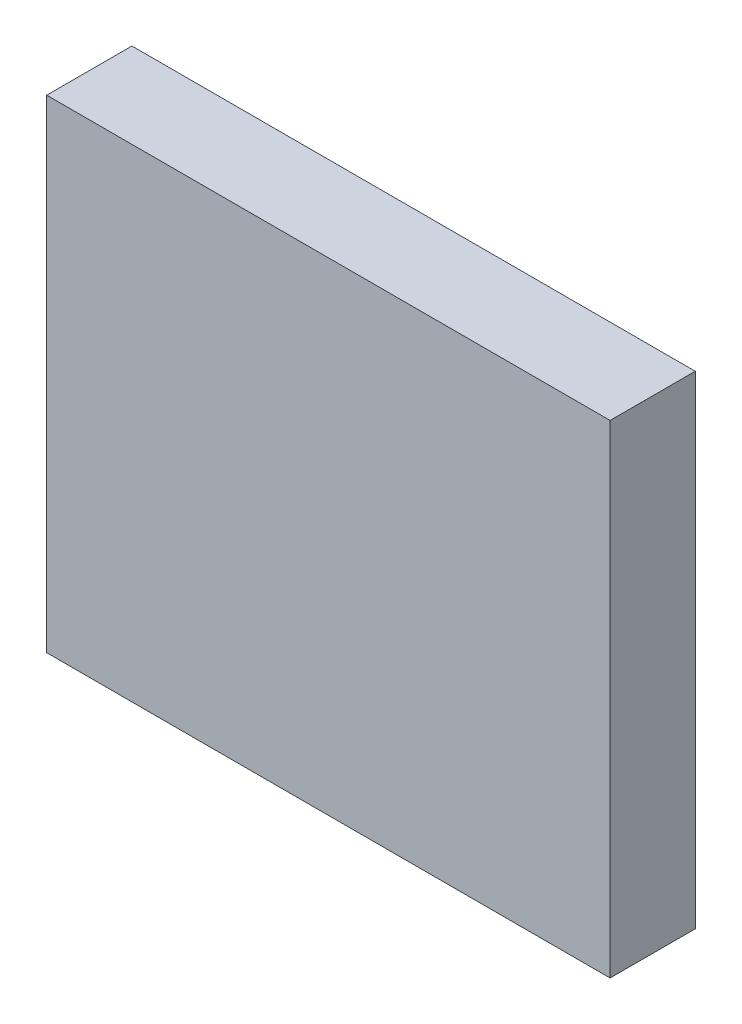
ISO-10303-21;
HEADER;
FILE_DESCRIPTION(('STEP AP214'),'2;1');
FILE_NAME('part.step','',(''),(''),'','','');
FILE_SCHEMA(('AUTOMOTIVE_DESIGN { 1 0 10303 214 1 1 1 1 }'));
ENDSEC;
DATA;
#1=APPLICATION_CONTEXT('core data for automotive mechanical design processes');
#2=APPLICATION_PROTOCOL_DEFINITION('international standard','automotive_design',2000,#1);
#3=PRODUCT_CONTEXT('',#1,'mechanical');
#4=PRODUCT('Part','Part','',(#3));
#5=PRODUCT_RELATED_PRODUCT_CATEGORY('part','',(#4));
#6=PRODUCT_DEFINITION_FORMATION('','',#4);
#7=PRODUCT_DEFINITION_CONTEXT('part definition',#1,'design');
#8=PRODUCT_DEFINITION('design','',#6,#7);
#9=PRODUCT_DEFINITION_SHAPE('','',#8);
#10=(LENGTH_UNIT() NAMED_UNIT(*) SI_UNIT(.MILLI.,.METRE.));
#11=(NAMED_UNIT(*) PLANE_ANGLE_UNIT() SI_UNIT($,.RADIAN.));
#12=(NAMED_UNIT(*) SI_UNIT($,.STERADIAN.) SOLID_ANGLE_UNIT());
#13=UNCERTAINTY_MEASURE_WITH_UNIT(LENGTH_MEASURE(1.E-05),#10,'distance_accuracy_value','');
#14=(GEOMETRIC_REPRESENTATION_CONTEXT(3) GLOBAL_UNCERTAINTY_ASSIGNED_CONTEXT((#13)) GLOBAL_UNIT_ASSIGNED_CONTEXT((#10,
#11,#12)) REPRESENTATION_CONTEXT('',''));
#15=CARTESIAN_POINT('',(0.,0.,0.));
#16=DIRECTION('',(0.,0.,1.));
#17=DIRECTION('',(1.,0.,0.));
#18=AXIS2_PLACEMENT_3D('',#15,#16,#17);
#19=CARTESIAN_POINT('',(0.,0.,3.175));
#20=DIRECTION('',(1.,0.,0.));
#21=DIRECTION('',(0.,0.,-1.));
#22=AXIS2_PLACEMENT_3D('',#19,#20,#21);
#23=PLANE('',#22);
#24=DIRECTION('',(0.,-1.,0.));
#25=VECTOR('',#24,1.);
#26=CARTESIAN_POINT('',(0.,0.,0.));
#27=LINE('',#26,#25);
#28=CARTESIAN_POINT('',(0.,18.,0.));
#29=VERTEX_POINT('',#28);
#30=CARTESIAN_POINT('',(0.,0.,0.));
#31=VERTEX_POINT('',#30);
#32=EDGE_CURVE('E107',#29,#31,#27,.T.);
#33=ORIENTED_EDGE('',*,*,#32,.T.);
#34=DIRECTION('',(0.,0.,-1.));
#35=VECTOR('',#34,1.);
#36=CARTESIAN_POINT('',(0.,0.,3.175));
#37=LINE('',#36,#35);
#38=CARTESIAN_POINT('',(0.,0.,3.175));
#39=VERTEX_POINT('',#38);
#40=EDGE_CURVE('E11',#39,#31,#37,.T.);
#41=ORIENTED_EDGE('',*,*,#40,.F.);
#42=DIRECTION('',(0.,-1.,0.));
#43=VECTOR('',#42,1.);
#44=CARTESIAN_POINT('',(0.,0.,3.175));
#45=LINE('',#44,#43);
#46=CARTESIAN_POINT('',(0.,18.,3.175));
#47=VERTEX_POINT('',#46);
#48=EDGE_CURVE('E91',#47,#39,#45,.T.);
#49=ORIENTED_EDGE('',*,*,#48,.F.);
#50=DIRECTION('',(0.,0.,-1.));
#51=VECTOR('',#50,1.);
#52=CARTESIAN_POINT('',(0.,18.,3.175));
#53=LINE('',#52,#51);
#54=EDGE_CURVE('E103',#47,#29,#53,.T.);
#55=ORIENTED_EDGE('',*,*,#54,.T.);
#56=EDGE_LOOP('',(#33,#41,#49,#55));
#57=FACE_BOUND('',#56,.T.);
#58=ADVANCED_FACE('F39',(#57),#23,.F.);
#59=CARTESIAN_POINT('',(0.,0.,3.175));
#60=DIRECTION('',(0.,1.,0.));
#61=DIRECTION('',(0.,0.,1.));
#62=AXIS2_PLACEMENT_3D('',#59,#60,#61);
#63=PLANE('',#62);
#64=DIRECTION('',(1.,0.,0.));
#65=VECTOR('',#64,1.);
#66=CARTESIAN_POINT('',(0.,0.,0.));
#67=LINE('',#66,#65);
#68=CARTESIAN_POINT('',(21.,0.,0.));
#69=VERTEX_POINT('',#68);
#70=EDGE_CURVE('E96',#31,#69,#67,.T.);
#71=ORIENTED_EDGE('',*,*,#70,.T.);
#72=DIRECTION('',(0.,0.,-1.));
#73=VECTOR('',#72,1.);
#74=CARTESIAN_POINT('',(21.,0.,3.175));
#75=LINE('',#74,#73);
#76=CARTESIAN_POINT('',(21.,0.,3.175));
#77=VERTEX_POINT('',#76);
#78=EDGE_CURVE('E48',#77,#69,#75,.T.);
#79=ORIENTED_EDGE('',*,*,#78,.F.);
#80=DIRECTION('',(1.,0.,0.));
#81=VECTOR('',#80,1.);
#82=CARTESIAN_POINT('',(0.,0.,3.175));
#83=LINE('',#82,#81);
#84=EDGE_CURVE('E86',#39,#77,#83,.T.);
#85=ORIENTED_EDGE('',*,*,#84,.F.);
#86=ORIENTED_EDGE('',*,*,#40,.T.);
#87=EDGE_LOOP('',(#71,#79,#85,#86));
#88=FACE_BOUND('',#87,.T.);
#89=ADVANCED_FACE('F95',(#88),#63,.F.);
#90=CARTESIAN_POINT('',(21.,0.,3.175));
#91=DIRECTION('',(-1.,0.,0.));
#92=DIRECTION('',(0.,0.,1.));
#93=AXIS2_PLACEMENT_3D('',#90,#91,#92);
#94=PLANE('',#93);
#95=DIRECTION('',(0.,1.,0.));
#96=VECTOR('',#95,1.);
#97=CARTESIAN_POINT('',(21.,0.,0.));
#98=LINE('',#97,#96);
#99=CARTESIAN_POINT('',(21.,18.,0.));
#100=VERTEX_POINT('',#99);
#101=EDGE_CURVE('E73',#69,#100,#98,.T.);
#102=ORIENTED_EDGE('',*,*,#101,.T.);
#103=DIRECTION('',(0.,0.,-1.));
#104=VECTOR('',#103,1.);
#105=CARTESIAN_POINT('',(21.,18.,3.175));
#106=LINE('',#105,#104);
#107=CARTESIAN_POINT('',(21.,18.,3.175));
#108=VERTEX_POINT('',#107);
#109=EDGE_CURVE('E98',#108,#100,#106,.T.);
#110=ORIENTED_EDGE('',*,*,#109,.F.);
#111=DIRECTION('',(0.,1.,0.));
#112=VECTOR('',#111,1.);
#113=CARTESIAN_POINT('',(21.,0.,3.175));
#114=LINE('',#113,#112);
#115=EDGE_CURVE('E89',#77,#108,#114,.T.);
#116=ORIENTED_EDGE('',*,*,#115,.F.);
#117=ORIENTED_EDGE('',*,*,#78,.T.);
#118=EDGE_LOOP('',(#102,#110,#116,#117));
#119=FACE_BOUND('',#118,.T.);
#120=ADVANCED_FACE('F99',(#119),#94,.F.);
#121=CARTESIAN_POINT('',(0.,18.,3.175));
#122=DIRECTION('',(0.,-1.,0.));
#123=DIRECTION('',(0.,0.,-1.));
#124=AXIS2_PLACEMENT_3D('',#121,#122,#123);
#125=PLANE('',#124);
#126=DIRECTION('',(-1.,0.,0.));
#127=VECTOR('',#126,1.);
#128=CARTESIAN_POINT('',(0.,18.,0.));
#129=LINE('',#128,#127);
#130=EDGE_CURVE('E79',#100,#29,#129,.T.);
#131=ORIENTED_EDGE('',*,*,#130,.T.);
#132=ORIENTED_EDGE('',*,*,#54,.F.);
#133=DIRECTION('',(-1.,0.,0.));
#134=VECTOR('',#133,1.);
#135=CARTESIAN_POINT('',(0.,18.,3.175));
#136=LINE('',#135,#134);
#137=EDGE_CURVE('E56',#108,#47,#136,.T.);
#138=ORIENTED_EDGE('',*,*,#137,.F.);
#139=ORIENTED_EDGE('',*,*,#109,.T.);
#140=EDGE_LOOP('',(#131,#132,#138,#139));
#141=FACE_BOUND('',#140,.T.);
#142=ADVANCED_FACE('F120',(#141),#125,.F.);
#143=CARTESIAN_POINT('',(0.,0.,3.175));
#144=DIRECTION('',(0.,0.,-1.));
#145=DIRECTION('',(-1.,0.,0.));
#146=AXIS2_PLACEMENT_3D('',#143,#144,#145);
#147=PLANE('',#146);
#148=ORIENTED_EDGE('',*,*,#48,.T.);
#149=ORIENTED_EDGE('',*,*,#84,.T.);
#150=ORIENTED_EDGE('',*,*,#115,.T.);
#151=ORIENTED_EDGE('',*,*,#137,.T.);
#152=EDGE_LOOP('',(#148,#149,#150,#151));
#153=FACE_BOUND('',#152,.T.);
#154=ADVANCED_FACE('F87',(#153),#147,.F.);
#155=CARTESIAN_POINT('',(0.,0.,0.));
#156=DIRECTION('',(0.,0.,-1.));
#157=DIRECTION('',(-1.,0.,0.));
#158=AXIS2_PLACEMENT_3D('',#155,#156,#157);
#159=PLANE('',#158);
#160=ORIENTED_EDGE('',*,*,#32,.F.);
#161=ORIENTED_EDGE('',*,*,#130,.F.);
#162=ORIENTED_EDGE('',*,*,#101,.F.);
#163=ORIENTED_EDGE('',*,*,#70,.F.);
#164=EDGE_LOOP('',(#160,#161,#162,#163));
#165=FACE_BOUND('',#164,.T.);
#166=ADVANCED_FACE('F123',(#165),#159,.T.);
#167=CLOSED_SHELL('',(#58,#89,#120,#142,#154,#166));
#168=MANIFOLD_SOLID_BREP('B2',#167);
#169=ADVANCED_BREP_SHAPE_REPRESENTATION('',(#18,#168),#14);
#170=SHAPE_DEFINITION_REPRESENTATION(#9,#169);
ENDSEC;
END-ISO-10303-21;
